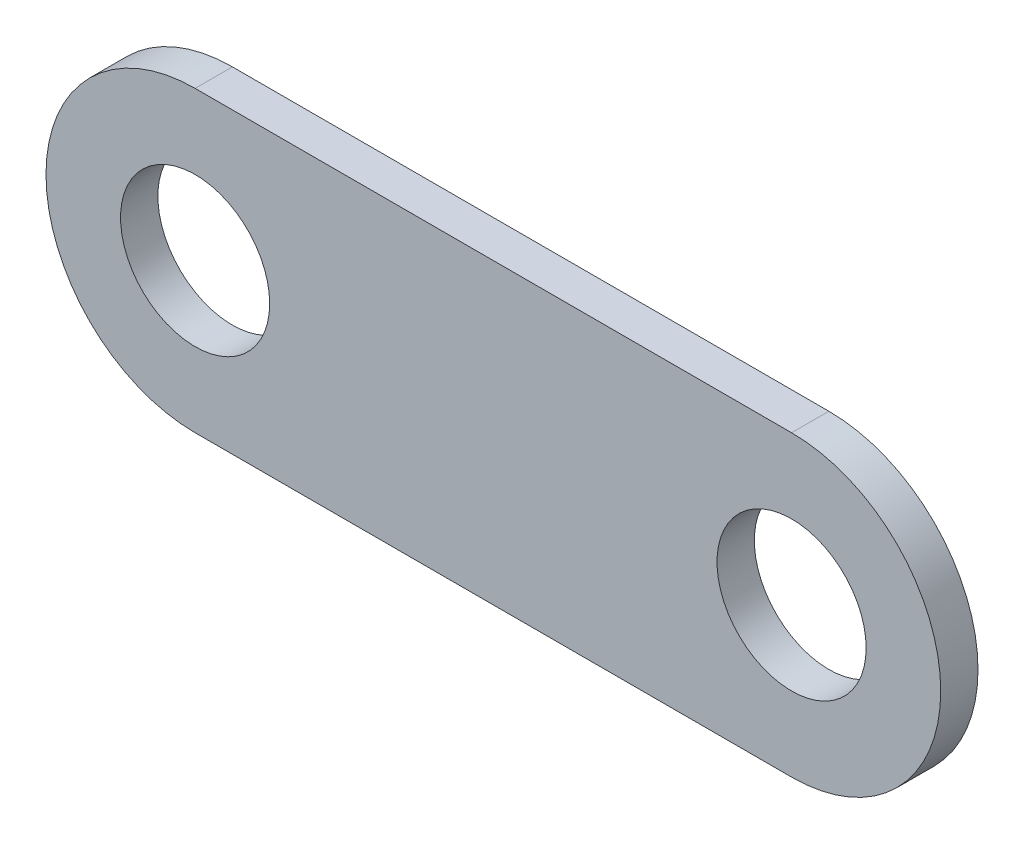
ISO-10303-21;
HEADER;
FILE_DESCRIPTION(('STEP AP214'),'2;1');
FILE_NAME('part.step','',(''),(''),'','','');
FILE_SCHEMA(('AUTOMOTIVE_DESIGN { 1 0 10303 214 1 1 1 1 }'));
ENDSEC;
DATA;
#1=APPLICATION_CONTEXT('core data for automotive mechanical design processes');
#2=APPLICATION_PROTOCOL_DEFINITION('international standard','automotive_design',2000,#1);
#3=PRODUCT_CONTEXT('',#1,'mechanical');
#4=PRODUCT('Part','Part','',(#3));
#5=PRODUCT_RELATED_PRODUCT_CATEGORY('part','',(#4));
#6=PRODUCT_DEFINITION_FORMATION('','',#4);
#7=PRODUCT_DEFINITION_CONTEXT('part definition',#1,'design');
#8=PRODUCT_DEFINITION('design','',#6,#7);
#9=PRODUCT_DEFINITION_SHAPE('','',#8);
#10=(LENGTH_UNIT() NAMED_UNIT(*) SI_UNIT(.MILLI.,.METRE.));
#11=(NAMED_UNIT(*) PLANE_ANGLE_UNIT() SI_UNIT($,.RADIAN.));
#12=(NAMED_UNIT(*) SI_UNIT($,.STERADIAN.) SOLID_ANGLE_UNIT());
#13=UNCERTAINTY_MEASURE_WITH_UNIT(LENGTH_MEASURE(1.E-05),#10,'distance_accuracy_value','');
#14=(GEOMETRIC_REPRESENTATION_CONTEXT(3) GLOBAL_UNCERTAINTY_ASSIGNED_CONTEXT((#13)) GLOBAL_UNIT_ASSIGNED_CONTEXT((#10,
#11,#12)) REPRESENTATION_CONTEXT('',''));
#15=CARTESIAN_POINT('',(0.,0.,0.));
#16=DIRECTION('',(0.,0.,1.));
#17=DIRECTION('',(1.,0.,0.));
#18=AXIS2_PLACEMENT_3D('',#15,#16,#17);
#19=CARTESIAN_POINT('',(51.5130500758725,1.55705614567526,5.));
#20=DIRECTION('',(0.,0.,-1.));
#21=DIRECTION('',(-1.,0.,0.));
#22=AXIS2_PLACEMENT_3D('',#19,#20,#21);
#23=CYLINDRICAL_SURFACE('',#22,20.);
#24=CARTESIAN_POINT('',(51.5130500758725,1.55705614567526,0.));
#25=DIRECTION('',(0.,0.,1.));
#26=DIRECTION('',(1.,0.,0.));
#27=AXIS2_PLACEMENT_3D('',#24,#25,#26);
#28=CIRCLE('',#27,20.);
#29=CARTESIAN_POINT('',(51.5130500758725,-18.4429438543247,0.));
#30=VERTEX_POINT('',#29);
#31=CARTESIAN_POINT('',(51.5130500758725,21.5570561456753,0.));
#32=VERTEX_POINT('',#31);
#33=EDGE_CURVE('E97',#30,#32,#28,.T.);
#34=ORIENTED_EDGE('',*,*,#33,.T.);
#35=DIRECTION('',(0.,0.,-1.));
#36=VECTOR('',#35,1.);
#37=CARTESIAN_POINT('',(51.5130500758725,21.5570561456753,5.));
#38=LINE('',#37,#36);
#39=CARTESIAN_POINT('',(51.5130500758725,21.5570561456753,5.));
#40=VERTEX_POINT('',#39);
#41=EDGE_CURVE('E11',#40,#32,#38,.T.);
#42=ORIENTED_EDGE('',*,*,#41,.F.);
#43=CARTESIAN_POINT('',(51.5130500758725,1.55705614567526,5.));
#44=DIRECTION('',(0.,0.,1.));
#45=DIRECTION('',(1.,0.,0.));
#46=AXIS2_PLACEMENT_3D('',#43,#44,#45);
#47=CIRCLE('',#46,20.);
#48=CARTESIAN_POINT('',(51.5130500758725,-18.4429438543247,5.));
#49=VERTEX_POINT('',#48);
#50=EDGE_CURVE('E85',#49,#40,#47,.T.);
#51=ORIENTED_EDGE('',*,*,#50,.F.);
#52=DIRECTION('',(0.,0.,-1.));
#53=VECTOR('',#52,1.);
#54=CARTESIAN_POINT('',(51.5130500758725,-18.4429438543247,5.));
#55=LINE('',#54,#53);
#56=EDGE_CURVE('E93',#49,#30,#55,.T.);
#57=ORIENTED_EDGE('',*,*,#56,.T.);
#58=EDGE_LOOP('',(#34,#42,#51,#57));
#59=FACE_BOUND('',#58,.T.);
#60=ADVANCED_FACE('F34',(#59),#23,.T.);
#61=CARTESIAN_POINT('',(51.5130500758725,21.5570561456753,5.));
#62=DIRECTION('',(0.,-1.,0.));
#63=DIRECTION('',(1.,0.,0.));
#64=AXIS2_PLACEMENT_3D('',#61,#62,#63);
#65=PLANE('',#64);
#66=DIRECTION('',(-1.,0.,0.));
#67=VECTOR('',#66,1.);
#68=CARTESIAN_POINT('',(51.5130500758725,21.5570561456753,0.));
#69=LINE('',#68,#67);
#70=CARTESIAN_POINT('',(-28.4869499241275,21.5570561456753,0.));
#71=VERTEX_POINT('',#70);
#72=EDGE_CURVE('E89',#32,#71,#69,.T.);
#73=ORIENTED_EDGE('',*,*,#72,.T.);
#74=DIRECTION('',(0.,0.,-1.));
#75=VECTOR('',#74,1.);
#76=CARTESIAN_POINT('',(-28.4869499241275,21.5570561456753,5.));
#77=LINE('',#76,#75);
#78=CARTESIAN_POINT('',(-28.4869499241275,21.5570561456753,5.));
#79=VERTEX_POINT('',#78);
#80=EDGE_CURVE('E42',#79,#71,#77,.T.);
#81=ORIENTED_EDGE('',*,*,#80,.F.);
#82=DIRECTION('',(-1.,0.,0.));
#83=VECTOR('',#82,1.);
#84=CARTESIAN_POINT('',(51.5130500758725,21.5570561456753,5.));
#85=LINE('',#84,#83);
#86=EDGE_CURVE('E80',#40,#79,#85,.T.);
#87=ORIENTED_EDGE('',*,*,#86,.F.);
#88=ORIENTED_EDGE('',*,*,#41,.T.);
#89=EDGE_LOOP('',(#73,#81,#87,#88));
#90=FACE_BOUND('',#89,.T.);
#91=ADVANCED_FACE('F88',(#90),#65,.F.);
#92=CARTESIAN_POINT('',(-28.4869499241275,1.55705614567526,5.));
#93=DIRECTION('',(0.,0.,-1.));
#94=DIRECTION('',(-1.,0.,0.));
#95=AXIS2_PLACEMENT_3D('',#92,#93,#94);
#96=CYLINDRICAL_SURFACE('',#95,20.);
#97=CARTESIAN_POINT('',(-28.4869499241275,1.55705614567526,0.));
#98=DIRECTION('',(0.,0.,1.));
#99=DIRECTION('',(1.,0.,0.));
#100=AXIS2_PLACEMENT_3D('',#97,#98,#99);
#101=CIRCLE('',#100,20.);
#102=CARTESIAN_POINT('',(-28.4869499241275,-18.4429438543247,0.));
#103=VERTEX_POINT('',#102);
#104=EDGE_CURVE('E67',#71,#103,#101,.T.);
#105=ORIENTED_EDGE('',*,*,#104,.T.);
#106=DIRECTION('',(0.,0.,-1.));
#107=VECTOR('',#106,1.);
#108=CARTESIAN_POINT('',(-28.4869499241275,-18.4429438543247,5.));
#109=LINE('',#108,#107);
#110=CARTESIAN_POINT('',(-28.4869499241275,-18.4429438543247,5.));
#111=VERTEX_POINT('',#110);
#112=EDGE_CURVE('E90',#111,#103,#109,.T.);
#113=ORIENTED_EDGE('',*,*,#112,.F.);
#114=CARTESIAN_POINT('',(-28.4869499241275,1.55705614567526,5.));
#115=DIRECTION('',(0.,0.,1.));
#116=DIRECTION('',(1.,0.,0.));
#117=AXIS2_PLACEMENT_3D('',#114,#115,#116);
#118=CIRCLE('',#117,20.);
#119=EDGE_CURVE('E83',#79,#111,#118,.T.);
#120=ORIENTED_EDGE('',*,*,#119,.F.);
#121=ORIENTED_EDGE('',*,*,#80,.T.);
#122=EDGE_LOOP('',(#105,#113,#120,#121));
#123=FACE_BOUND('',#122,.T.);
#124=ADVANCED_FACE('F91',(#123),#96,.T.);
#125=CARTESIAN_POINT('',(-28.4869499241275,-18.4429438543247,5.));
#126=DIRECTION('',(0.,1.,0.));
#127=DIRECTION('',(0.,0.,1.));
#128=AXIS2_PLACEMENT_3D('',#125,#126,#127);
#129=PLANE('',#128);
#130=DIRECTION('',(1.,0.,0.));
#131=VECTOR('',#130,1.);
#132=CARTESIAN_POINT('',(-28.4869499241275,-18.4429438543247,0.));
#133=LINE('',#132,#131);
#134=EDGE_CURVE('E73',#103,#30,#133,.T.);
#135=ORIENTED_EDGE('',*,*,#134,.T.);
#136=ORIENTED_EDGE('',*,*,#56,.F.);
#137=DIRECTION('',(1.,0.,0.));
#138=VECTOR('',#137,1.);
#139=CARTESIAN_POINT('',(-28.4869499241275,-18.4429438543247,5.));
#140=LINE('',#139,#138);
#141=EDGE_CURVE('E50',#111,#49,#140,.T.);
#142=ORIENTED_EDGE('',*,*,#141,.F.);
#143=ORIENTED_EDGE('',*,*,#112,.T.);
#144=EDGE_LOOP('',(#135,#136,#142,#143));
#145=FACE_BOUND('',#144,.T.);
#146=ADVANCED_FACE('F105',(#145),#129,.F.);
#147=CARTESIAN_POINT('',(51.5130500758725,1.55705614567526,5.));
#148=DIRECTION('',(0.,0.,1.));
#149=DIRECTION('',(1.,0.,0.));
#150=AXIS2_PLACEMENT_3D('',#147,#148,#149);
#151=PLANE('',#150);
#152=CARTESIAN_POINT('',(51.5130500758725,1.55705614567526,5.));
#153=DIRECTION('',(0.,0.,1.));
#154=DIRECTION('',(1.,0.,0.));
#155=AXIS2_PLACEMENT_3D('',#152,#153,#154);
#156=CIRCLE('',#155,10.);
#157=CARTESIAN_POINT('',(61.5130500758725,1.55705614567526,5.));
#158=VERTEX_POINT('',#157);
#159=EDGE_CURVE('E117',#158,#158,#156,.T.);
#160=ORIENTED_EDGE('',*,*,#159,.F.);
#161=EDGE_LOOP('',(#160));
#162=FACE_BOUND('',#161,.T.);
#163=CARTESIAN_POINT('',(-28.4869499241275,1.55705614567526,5.));
#164=DIRECTION('',(0.,0.,1.));
#165=DIRECTION('',(1.,0.,0.));
#166=AXIS2_PLACEMENT_3D('',#163,#164,#165);
#167=CIRCLE('',#166,10.);
#168=CARTESIAN_POINT('',(-18.4869499241275,1.55705614567526,5.));
#169=VERTEX_POINT('',#168);
#170=EDGE_CURVE('E111',#169,#169,#167,.T.);
#171=ORIENTED_EDGE('',*,*,#170,.F.);
#172=EDGE_LOOP('',(#171));
#173=FACE_BOUND('',#172,.T.);
#174=ORIENTED_EDGE('',*,*,#50,.T.);
#175=ORIENTED_EDGE('',*,*,#86,.T.);
#176=ORIENTED_EDGE('',*,*,#119,.T.);
#177=ORIENTED_EDGE('',*,*,#141,.T.);
#178=EDGE_LOOP('',(#174,#175,#176,#177));
#179=FACE_BOUND('',#178,.T.);
#180=ADVANCED_FACE('F81',(#162,#173,#179),#151,.T.);
#181=CARTESIAN_POINT('',(51.5130500758725,1.55705614567526,0.));
#182=DIRECTION('',(0.,0.,1.));
#183=DIRECTION('',(1.,0.,0.));
#184=AXIS2_PLACEMENT_3D('',#181,#182,#183);
#185=PLANE('',#184);
#186=CARTESIAN_POINT('',(51.5130500758725,1.55705614567526,0.));
#187=DIRECTION('',(0.,0.,1.));
#188=DIRECTION('',(1.,0.,0.));
#189=AXIS2_PLACEMENT_3D('',#186,#187,#188);
#190=CIRCLE('',#189,10.);
#191=CARTESIAN_POINT('',(61.5130500758725,1.55705614567526,0.));
#192=VERTEX_POINT('',#191);
#193=EDGE_CURVE('E114',#192,#192,#190,.T.);
#194=ORIENTED_EDGE('',*,*,#193,.T.);
#195=EDGE_LOOP('',(#194));
#196=FACE_BOUND('',#195,.T.);
#197=CARTESIAN_POINT('',(-28.4869499241275,1.55705614567526,0.));
#198=DIRECTION('',(0.,0.,1.));
#199=DIRECTION('',(1.,0.,0.));
#200=AXIS2_PLACEMENT_3D('',#197,#198,#199);
#201=CIRCLE('',#200,10.);
#202=CARTESIAN_POINT('',(-18.4869499241275,1.55705614567526,0.));
#203=VERTEX_POINT('',#202);
#204=EDGE_CURVE('E100',#203,#203,#201,.T.);
#205=ORIENTED_EDGE('',*,*,#204,.T.);
#206=EDGE_LOOP('',(#205));
#207=FACE_BOUND('',#206,.T.);
#208=ORIENTED_EDGE('',*,*,#33,.F.);
#209=ORIENTED_EDGE('',*,*,#134,.F.);
#210=ORIENTED_EDGE('',*,*,#104,.F.);
#211=ORIENTED_EDGE('',*,*,#72,.F.);
#212=EDGE_LOOP('',(#208,#209,#210,#211));
#213=FACE_BOUND('',#212,.T.);
#214=ADVANCED_FACE('F108',(#196,#207,#213),#185,.F.);
#215=CARTESIAN_POINT('',(-28.4869499241275,1.55705614567526,0.));
#216=DIRECTION('',(0.,0.,1.));
#217=DIRECTION('',(1.,0.,0.));
#218=AXIS2_PLACEMENT_3D('',#215,#216,#217);
#219=CYLINDRICAL_SURFACE('',#218,10.);
#220=ORIENTED_EDGE('',*,*,#204,.F.);
#221=EDGE_LOOP('',(#220));
#222=FACE_BOUND('',#221,.T.);
#223=ORIENTED_EDGE('',*,*,#170,.T.);
#224=EDGE_LOOP('',(#223));
#225=FACE_BOUND('',#224,.T.);
#226=ADVANCED_FACE('F128',(#222,#225),#219,.F.);
#227=CARTESIAN_POINT('',(51.5130500758725,1.55705614567526,0.));
#228=DIRECTION('',(0.,0.,1.));
#229=DIRECTION('',(1.,0.,0.));
#230=AXIS2_PLACEMENT_3D('',#227,#228,#229);
#231=CYLINDRICAL_SURFACE('',#230,10.);
#232=ORIENTED_EDGE('',*,*,#193,.F.);
#233=EDGE_LOOP('',(#232));
#234=FACE_BOUND('',#233,.T.);
#235=ORIENTED_EDGE('',*,*,#159,.T.);
#236=EDGE_LOOP('',(#235));
#237=FACE_BOUND('',#236,.T.);
#238=ADVANCED_FACE('F125',(#234,#237),#231,.F.);
#239=CLOSED_SHELL('',(#60,#91,#124,#146,#180,#214,#226,#238));
#240=MANIFOLD_SOLID_BREP('B2',#239);
#241=ADVANCED_BREP_SHAPE_REPRESENTATION('',(#18,#240),#14);
#242=SHAPE_DEFINITION_REPRESENTATION(#9,#241);
ENDSEC;
END-ISO-10303-21;
